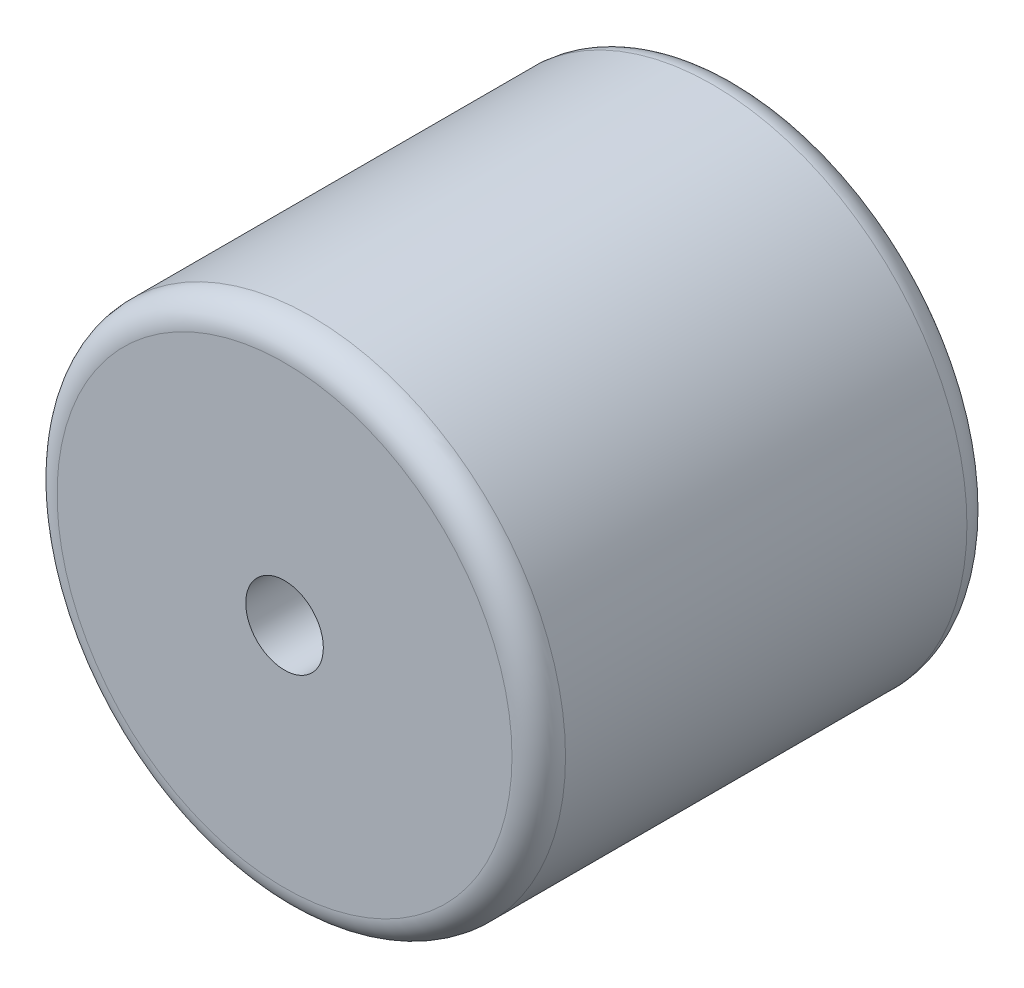
ISO-10303-21;
HEADER;
FILE_DESCRIPTION(('STEP AP214'),'2;1');
FILE_NAME('part.step','',(''),(''),'','','');
FILE_SCHEMA(('AUTOMOTIVE_DESIGN { 1 0 10303 214 1 1 1 1 }'));
ENDSEC;
DATA;
#1=APPLICATION_CONTEXT('core data for automotive mechanical design processes');
#2=APPLICATION_PROTOCOL_DEFINITION('international standard','automotive_design',2000,#1);
#3=PRODUCT_CONTEXT('',#1,'mechanical');
#4=PRODUCT('Part','Part','',(#3));
#5=PRODUCT_RELATED_PRODUCT_CATEGORY('part','',(#4));
#6=PRODUCT_DEFINITION_FORMATION('','',#4);
#7=PRODUCT_DEFINITION_CONTEXT('part definition',#1,'design');
#8=PRODUCT_DEFINITION('design','',#6,#7);
#9=PRODUCT_DEFINITION_SHAPE('','',#8);
#10=(LENGTH_UNIT() NAMED_UNIT(*) SI_UNIT(.MILLI.,.METRE.));
#11=(NAMED_UNIT(*) PLANE_ANGLE_UNIT() SI_UNIT($,.RADIAN.));
#12=(NAMED_UNIT(*) SI_UNIT($,.STERADIAN.) SOLID_ANGLE_UNIT());
#13=UNCERTAINTY_MEASURE_WITH_UNIT(LENGTH_MEASURE(1.E-05),#10,'distance_accuracy_value','');
#14=(GEOMETRIC_REPRESENTATION_CONTEXT(3) GLOBAL_UNCERTAINTY_ASSIGNED_CONTEXT((#13)) GLOBAL_UNIT_ASSIGNED_CONTEXT((#10,
#11,#12)) REPRESENTATION_CONTEXT('',''));
#15=CARTESIAN_POINT('',(0.,0.,0.));
#16=DIRECTION('',(0.,0.,1.));
#17=DIRECTION('',(1.,0.,0.));
#18=AXIS2_PLACEMENT_3D('',#15,#16,#17);
#19=CARTESIAN_POINT('',(0.,0.,17.));
#20=DIRECTION('',(0.,0.,-1.));
#21=DIRECTION('',(-1.,0.,0.));
#22=AXIS2_PLACEMENT_3D('',#19,#20,#21);
#23=CYLINDRICAL_SURFACE('',#22,9.5);
#24=CARTESIAN_POINT('',(0.,0.,1.));
#25=DIRECTION('',(0.,0.,1.));
#26=DIRECTION('',(1.,0.,0.));
#27=AXIS2_PLACEMENT_3D('',#24,#25,#26);
#28=CIRCLE('',#27,9.5);
#29=CARTESIAN_POINT('',(9.5,0.,1.));
#30=VERTEX_POINT('',#29);
#31=EDGE_CURVE('E50',#30,#30,#28,.T.);
#32=ORIENTED_EDGE('',*,*,#31,.T.);
#33=EDGE_LOOP('',(#32));
#34=FACE_BOUND('',#33,.T.);
#35=CARTESIAN_POINT('',(0.,0.,16.));
#36=DIRECTION('',(0.,0.,1.));
#37=DIRECTION('',(1.,0.,0.));
#38=AXIS2_PLACEMENT_3D('',#35,#36,#37);
#39=CIRCLE('',#38,9.5);
#40=CARTESIAN_POINT('',(9.5,0.,16.));
#41=VERTEX_POINT('',#40);
#42=EDGE_CURVE('E55',#41,#41,#39,.F.);
#43=ORIENTED_EDGE('',*,*,#42,.T.);
#44=EDGE_LOOP('',(#43));
#45=FACE_BOUND('',#44,.T.);
#46=ADVANCED_FACE('F37',(#34,#45),#23,.T.);
#47=CARTESIAN_POINT('',(0.,0.,17.));
#48=DIRECTION('',(0.,0.,1.));
#49=DIRECTION('',(1.,0.,0.));
#50=AXIS2_PLACEMENT_3D('',#47,#48,#49);
#51=PLANE('',#50);
#52=CARTESIAN_POINT('',(0.,0.,17.));
#53=DIRECTION('',(0.,0.,1.));
#54=DIRECTION('',(1.,0.,0.));
#55=AXIS2_PLACEMENT_3D('',#52,#53,#54);
#56=CIRCLE('',#55,1.45);
#57=CARTESIAN_POINT('',(1.45,0.,17.));
#58=VERTEX_POINT('',#57);
#59=EDGE_CURVE('E62',#58,#58,#56,.T.);
#60=ORIENTED_EDGE('',*,*,#59,.F.);
#61=EDGE_LOOP('',(#60));
#62=FACE_BOUND('',#61,.T.);
#63=CARTESIAN_POINT('',(0.,0.,17.));
#64=DIRECTION('',(0.,0.,1.));
#65=DIRECTION('',(1.,0.,0.));
#66=AXIS2_PLACEMENT_3D('',#63,#64,#65);
#67=CIRCLE('',#66,8.5);
#68=CARTESIAN_POINT('',(8.5,0.,17.));
#69=VERTEX_POINT('',#68);
#70=EDGE_CURVE('E10',#69,#69,#67,.T.);
#71=ORIENTED_EDGE('',*,*,#70,.T.);
#72=EDGE_LOOP('',(#71));
#73=FACE_BOUND('',#72,.T.);
#74=ADVANCED_FACE('F78',(#62,#73),#51,.T.);
#75=CARTESIAN_POINT('',(0.,0.,0.));
#76=DIRECTION('',(0.,0.,1.));
#77=DIRECTION('',(1.,0.,0.));
#78=AXIS2_PLACEMENT_3D('',#75,#76,#77);
#79=PLANE('',#78);
#80=CARTESIAN_POINT('',(0.,0.,0.));
#81=DIRECTION('',(0.,0.,1.));
#82=DIRECTION('',(1.,0.,0.));
#83=AXIS2_PLACEMENT_3D('',#80,#81,#82);
#84=CIRCLE('',#83,1.45);
#85=CARTESIAN_POINT('',(1.45,0.,0.));
#86=VERTEX_POINT('',#85);
#87=EDGE_CURVE('E61',#86,#86,#84,.T.);
#88=ORIENTED_EDGE('',*,*,#87,.T.);
#89=EDGE_LOOP('',(#88));
#90=FACE_BOUND('',#89,.T.);
#91=CARTESIAN_POINT('',(0.,0.,0.));
#92=DIRECTION('',(0.,0.,1.));
#93=DIRECTION('',(1.,0.,0.));
#94=AXIS2_PLACEMENT_3D('',#91,#92,#93);
#95=CIRCLE('',#94,8.5);
#96=CARTESIAN_POINT('',(8.5,0.,0.));
#97=VERTEX_POINT('',#96);
#98=EDGE_CURVE('E45',#97,#97,#95,.F.);
#99=ORIENTED_EDGE('',*,*,#98,.T.);
#100=EDGE_LOOP('',(#99));
#101=FACE_BOUND('',#100,.T.);
#102=ADVANCED_FACE('F70',(#90,#101),#79,.F.);
#103=CARTESIAN_POINT('',(0.,0.,1.));
#104=DIRECTION('',(0.,0.,1.));
#105=DIRECTION('',(1.,0.,0.));
#106=AXIS2_PLACEMENT_3D('',#103,#104,#105);
#107=TOROIDAL_SURFACE('',#106,8.5,1.);
#108=ORIENTED_EDGE('',*,*,#98,.F.);
#109=EDGE_LOOP('',(#108));
#110=FACE_BOUND('',#109,.T.);
#111=ORIENTED_EDGE('',*,*,#31,.F.);
#112=EDGE_LOOP('',(#111));
#113=FACE_BOUND('',#112,.T.);
#114=ADVANCED_FACE('F85',(#110,#113),#107,.T.);
#115=CARTESIAN_POINT('',(0.,0.,16.));
#116=DIRECTION('',(0.,0.,1.));
#117=DIRECTION('',(1.,0.,0.));
#118=AXIS2_PLACEMENT_3D('',#115,#116,#117);
#119=TOROIDAL_SURFACE('',#118,8.5,1.);
#120=ORIENTED_EDGE('',*,*,#42,.F.);
#121=EDGE_LOOP('',(#120));
#122=FACE_BOUND('',#121,.T.);
#123=ORIENTED_EDGE('',*,*,#70,.F.);
#124=EDGE_LOOP('',(#123));
#125=FACE_BOUND('',#124,.T.);
#126=ADVANCED_FACE('F39',(#122,#125),#119,.T.);
#127=CARTESIAN_POINT('',(0.,0.,0.));
#128=DIRECTION('',(0.,0.,1.));
#129=DIRECTION('',(1.,0.,0.));
#130=AXIS2_PLACEMENT_3D('',#127,#128,#129);
#131=CYLINDRICAL_SURFACE('',#130,1.45);
#132=ORIENTED_EDGE('',*,*,#87,.F.);
#133=EDGE_LOOP('',(#132));
#134=FACE_BOUND('',#133,.T.);
#135=ORIENTED_EDGE('',*,*,#59,.T.);
#136=EDGE_LOOP('',(#135));
#137=FACE_BOUND('',#136,.T.);
#138=ADVANCED_FACE('F72',(#134,#137),#131,.F.);
#139=CLOSED_SHELL('',(#46,#74,#102,#114,#126,#138));
#140=MANIFOLD_SOLID_BREP('B2',#139);
#141=ADVANCED_BREP_SHAPE_REPRESENTATION('',(#18,#140),#14);
#142=SHAPE_DEFINITION_REPRESENTATION(#9,#141);
ENDSEC;
END-ISO-10303-21;
